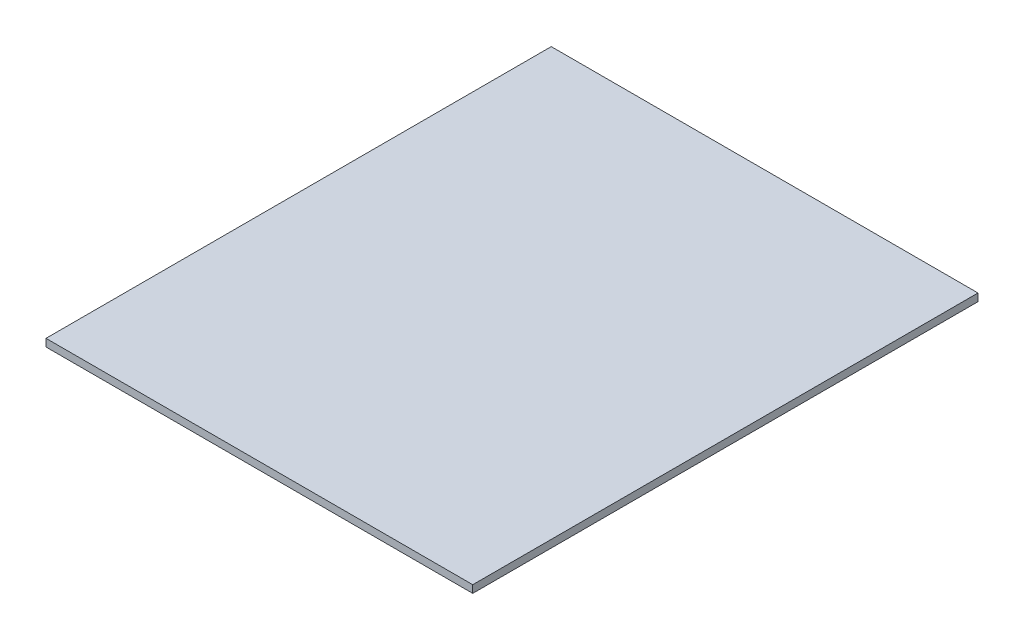
ISO-10303-21;
HEADER;
FILE_DESCRIPTION(('STEP AP214'),'2;1');
FILE_NAME('part.step','',(''),(''),'','','');
FILE_SCHEMA(('AUTOMOTIVE_DESIGN { 1 0 10303 214 1 1 1 1 }'));
ENDSEC;
DATA;
#1=APPLICATION_CONTEXT('core data for automotive mechanical design processes');
#2=APPLICATION_PROTOCOL_DEFINITION('international standard','automotive_design',2000,#1);
#3=PRODUCT_CONTEXT('',#1,'mechanical');
#4=PRODUCT('Part','Part','',(#3));
#5=PRODUCT_RELATED_PRODUCT_CATEGORY('part','',(#4));
#6=PRODUCT_DEFINITION_FORMATION('','',#4);
#7=PRODUCT_DEFINITION_CONTEXT('part definition',#1,'design');
#8=PRODUCT_DEFINITION('design','',#6,#7);
#9=PRODUCT_DEFINITION_SHAPE('','',#8);
#10=(LENGTH_UNIT() NAMED_UNIT(*) SI_UNIT(.MILLI.,.METRE.));
#11=(NAMED_UNIT(*) PLANE_ANGLE_UNIT() SI_UNIT($,.RADIAN.));
#12=(NAMED_UNIT(*) SI_UNIT($,.STERADIAN.) SOLID_ANGLE_UNIT());
#13=UNCERTAINTY_MEASURE_WITH_UNIT(LENGTH_MEASURE(1.E-05),#10,'distance_accuracy_value','');
#14=(GEOMETRIC_REPRESENTATION_CONTEXT(3) GLOBAL_UNCERTAINTY_ASSIGNED_CONTEXT((#13)) GLOBAL_UNIT_ASSIGNED_CONTEXT((#10,
#11,#12)) REPRESENTATION_CONTEXT('',''));
#15=CARTESIAN_POINT('',(0.,0.,0.));
#16=DIRECTION('',(0.,0.,1.));
#17=DIRECTION('',(1.,0.,0.));
#18=AXIS2_PLACEMENT_3D('',#15,#16,#17);
#19=CARTESIAN_POINT('',(0.,10.,0.));
#20=DIRECTION('',(1.,0.,0.));
#21=DIRECTION('',(0.,0.,-1.));
#22=AXIS2_PLACEMENT_3D('',#19,#20,#21);
#23=PLANE('',#22);
#24=DIRECTION('',(0.,0.,1.));
#25=VECTOR('',#24,1.);
#26=CARTESIAN_POINT('',(0.,0.,0.));
#27=LINE('',#26,#25);
#28=CARTESIAN_POINT('',(0.,0.,-670.));
#29=VERTEX_POINT('',#28);
#30=CARTESIAN_POINT('',(0.,0.,0.));
#31=VERTEX_POINT('',#30);
#32=EDGE_CURVE('E94',#29,#31,#27,.T.);
#33=ORIENTED_EDGE('',*,*,#32,.T.);
#34=DIRECTION('',(0.,-1.,0.));
#35=VECTOR('',#34,1.);
#36=CARTESIAN_POINT('',(0.,10.,0.));
#37=LINE('',#36,#35);
#38=CARTESIAN_POINT('',(0.,10.,0.));
#39=VERTEX_POINT('',#38);
#40=EDGE_CURVE('E11',#39,#31,#37,.T.);
#41=ORIENTED_EDGE('',*,*,#40,.F.);
#42=DIRECTION('',(0.,0.,1.));
#43=VECTOR('',#42,1.);
#44=CARTESIAN_POINT('',(0.,10.,0.));
#45=LINE('',#44,#43);
#46=CARTESIAN_POINT('',(0.,10.,-670.));
#47=VERTEX_POINT('',#46);
#48=EDGE_CURVE('E82',#47,#39,#45,.T.);
#49=ORIENTED_EDGE('',*,*,#48,.F.);
#50=DIRECTION('',(0.,-1.,0.));
#51=VECTOR('',#50,1.);
#52=CARTESIAN_POINT('',(0.,10.,-670.));
#53=LINE('',#52,#51);
#54=EDGE_CURVE('E90',#47,#29,#53,.T.);
#55=ORIENTED_EDGE('',*,*,#54,.T.);
#56=EDGE_LOOP('',(#33,#41,#49,#55));
#57=FACE_BOUND('',#56,.T.);
#58=ADVANCED_FACE('F31',(#57),#23,.F.);
#59=CARTESIAN_POINT('',(0.,10.,0.));
#60=DIRECTION('',(0.,0.,-1.));
#61=DIRECTION('',(-1.,0.,0.));
#62=AXIS2_PLACEMENT_3D('',#59,#60,#61);
#63=PLANE('',#62);
#64=DIRECTION('',(1.,0.,0.));
#65=VECTOR('',#64,1.);
#66=CARTESIAN_POINT('',(0.,0.,0.));
#67=LINE('',#66,#65);
#68=CARTESIAN_POINT('',(565.88,0.,0.));
#69=VERTEX_POINT('',#68);
#70=EDGE_CURVE('E86',#31,#69,#67,.T.);
#71=ORIENTED_EDGE('',*,*,#70,.T.);
#72=DIRECTION('',(0.,-1.,0.));
#73=VECTOR('',#72,1.);
#74=CARTESIAN_POINT('',(565.88,10.,0.));
#75=LINE('',#74,#73);
#76=CARTESIAN_POINT('',(565.88,10.,0.));
#77=VERTEX_POINT('',#76);
#78=EDGE_CURVE('E39',#77,#69,#75,.T.);
#79=ORIENTED_EDGE('',*,*,#78,.F.);
#80=DIRECTION('',(1.,0.,0.));
#81=VECTOR('',#80,1.);
#82=CARTESIAN_POINT('',(0.,10.,0.));
#83=LINE('',#82,#81);
#84=EDGE_CURVE('E77',#39,#77,#83,.T.);
#85=ORIENTED_EDGE('',*,*,#84,.F.);
#86=ORIENTED_EDGE('',*,*,#40,.T.);
#87=EDGE_LOOP('',(#71,#79,#85,#86));
#88=FACE_BOUND('',#87,.T.);
#89=ADVANCED_FACE('F85',(#88),#63,.F.);
#90=CARTESIAN_POINT('',(565.88,10.,0.));
#91=DIRECTION('',(-1.,0.,0.));
#92=DIRECTION('',(0.,0.,1.));
#93=AXIS2_PLACEMENT_3D('',#90,#91,#92);
#94=PLANE('',#93);
#95=DIRECTION('',(0.,0.,-1.));
#96=VECTOR('',#95,1.);
#97=CARTESIAN_POINT('',(565.88,0.,0.));
#98=LINE('',#97,#96);
#99=CARTESIAN_POINT('',(565.88,0.,-670.));
#100=VERTEX_POINT('',#99);
#101=EDGE_CURVE('E64',#69,#100,#98,.T.);
#102=ORIENTED_EDGE('',*,*,#101,.T.);
#103=DIRECTION('',(0.,-1.,0.));
#104=VECTOR('',#103,1.);
#105=CARTESIAN_POINT('',(565.88,10.,-670.));
#106=LINE('',#105,#104);
#107=CARTESIAN_POINT('',(565.88,10.,-670.));
#108=VERTEX_POINT('',#107);
#109=EDGE_CURVE('E87',#108,#100,#106,.T.);
#110=ORIENTED_EDGE('',*,*,#109,.F.);
#111=DIRECTION('',(0.,0.,-1.));
#112=VECTOR('',#111,1.);
#113=CARTESIAN_POINT('',(565.88,10.,0.));
#114=LINE('',#113,#112);
#115=EDGE_CURVE('E80',#77,#108,#114,.T.);
#116=ORIENTED_EDGE('',*,*,#115,.F.);
#117=ORIENTED_EDGE('',*,*,#78,.T.);
#118=EDGE_LOOP('',(#102,#110,#116,#117));
#119=FACE_BOUND('',#118,.T.);
#120=ADVANCED_FACE('F88',(#119),#94,.F.);
#121=CARTESIAN_POINT('',(0.,10.,-670.));
#122=DIRECTION('',(0.,0.,1.));
#123=DIRECTION('',(1.,0.,0.));
#124=AXIS2_PLACEMENT_3D('',#121,#122,#123);
#125=PLANE('',#124);
#126=DIRECTION('',(-1.,0.,0.));
#127=VECTOR('',#126,1.);
#128=CARTESIAN_POINT('',(0.,0.,-670.));
#129=LINE('',#128,#127);
#130=EDGE_CURVE('E70',#100,#29,#129,.T.);
#131=ORIENTED_EDGE('',*,*,#130,.T.);
#132=ORIENTED_EDGE('',*,*,#54,.F.);
#133=DIRECTION('',(-1.,0.,0.));
#134=VECTOR('',#133,1.);
#135=CARTESIAN_POINT('',(0.,10.,-670.));
#136=LINE('',#135,#134);
#137=EDGE_CURVE('E47',#108,#47,#136,.T.);
#138=ORIENTED_EDGE('',*,*,#137,.F.);
#139=ORIENTED_EDGE('',*,*,#109,.T.);
#140=EDGE_LOOP('',(#131,#132,#138,#139));
#141=FACE_BOUND('',#140,.T.);
#142=ADVANCED_FACE('F101',(#141),#125,.F.);
#143=CARTESIAN_POINT('',(0.,10.,-670.));
#144=DIRECTION('',(0.,-1.,0.));
#145=DIRECTION('',(0.,0.,-1.));
#146=AXIS2_PLACEMENT_3D('',#143,#144,#145);
#147=PLANE('',#146);
#148=ORIENTED_EDGE('',*,*,#48,.T.);
#149=ORIENTED_EDGE('',*,*,#84,.T.);
#150=ORIENTED_EDGE('',*,*,#115,.T.);
#151=ORIENTED_EDGE('',*,*,#137,.T.);
#152=EDGE_LOOP('',(#148,#149,#150,#151));
#153=FACE_BOUND('',#152,.T.);
#154=ADVANCED_FACE('F78',(#153),#147,.F.);
#155=CARTESIAN_POINT('',(0.,0.,-670.));
#156=DIRECTION('',(0.,-1.,0.));
#157=DIRECTION('',(0.,0.,-1.));
#158=AXIS2_PLACEMENT_3D('',#155,#156,#157);
#159=PLANE('',#158);
#160=ORIENTED_EDGE('',*,*,#32,.F.);
#161=ORIENTED_EDGE('',*,*,#130,.F.);
#162=ORIENTED_EDGE('',*,*,#101,.F.);
#163=ORIENTED_EDGE('',*,*,#70,.F.);
#164=EDGE_LOOP('',(#160,#161,#162,#163));
#165=FACE_BOUND('',#164,.T.);
#166=ADVANCED_FACE('F104',(#165),#159,.T.);
#167=CLOSED_SHELL('',(#58,#89,#120,#142,#154,#166));
#168=MANIFOLD_SOLID_BREP('B2',#167);
#169=ADVANCED_BREP_SHAPE_REPRESENTATION('',(#18,#168),#14);
#170=SHAPE_DEFINITION_REPRESENTATION(#9,#169);
ENDSEC;
END-ISO-10303-21;
